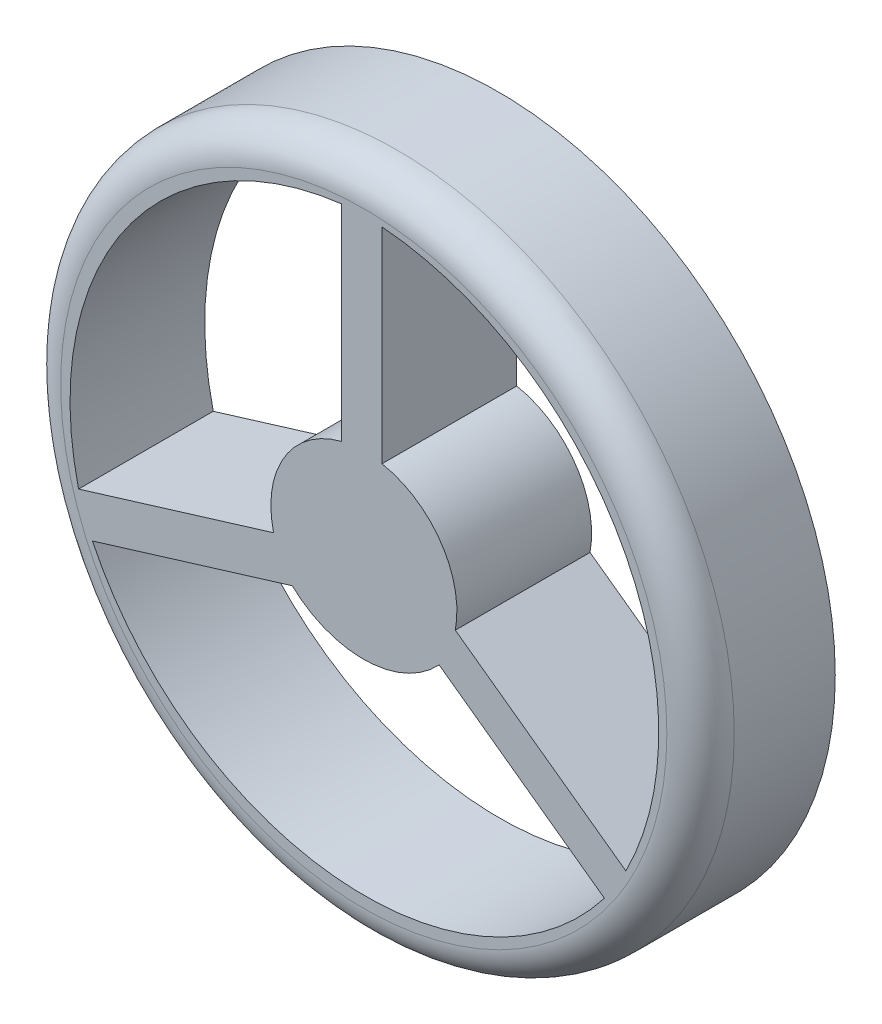
ISO-10303-21;
HEADER;
FILE_DESCRIPTION(('STEP AP214'),'2;1');
FILE_NAME('part.step','',(''),(''),'','','');
FILE_SCHEMA(('AUTOMOTIVE_DESIGN { 1 0 10303 214 1 1 1 1 }'));
ENDSEC;
DATA;
#1=APPLICATION_CONTEXT('core data for automotive mechanical design processes');
#2=APPLICATION_PROTOCOL_DEFINITION('international standard','automotive_design',2000,#1);
#3=PRODUCT_CONTEXT('',#1,'mechanical');
#4=PRODUCT('Part','Part','',(#3));
#5=PRODUCT_RELATED_PRODUCT_CATEGORY('part','',(#4));
#6=PRODUCT_DEFINITION_FORMATION('','',#4);
#7=PRODUCT_DEFINITION_CONTEXT('part definition',#1,'design');
#8=PRODUCT_DEFINITION('design','',#6,#7);
#9=PRODUCT_DEFINITION_SHAPE('','',#8);
#10=(LENGTH_UNIT() NAMED_UNIT(*) SI_UNIT(.MILLI.,.METRE.));
#11=(NAMED_UNIT(*) PLANE_ANGLE_UNIT() SI_UNIT($,.RADIAN.));
#12=(NAMED_UNIT(*) SI_UNIT($,.STERADIAN.) SOLID_ANGLE_UNIT());
#13=UNCERTAINTY_MEASURE_WITH_UNIT(LENGTH_MEASURE(1.E-05),#10,'distance_accuracy_value','');
#14=(GEOMETRIC_REPRESENTATION_CONTEXT(3) GLOBAL_UNCERTAINTY_ASSIGNED_CONTEXT((#13)) GLOBAL_UNIT_ASSIGNED_CONTEXT((#10,
#11,#12)) REPRESENTATION_CONTEXT('',''));
#15=CARTESIAN_POINT('',(0.,0.,0.));
#16=DIRECTION('',(0.,0.,1.));
#17=DIRECTION('',(1.,0.,0.));
#18=AXIS2_PLACEMENT_3D('',#15,#16,#17);
#19=CARTESIAN_POINT('',(0.,0.,1.016));
#20=DIRECTION('',(0.,0.,-1.));
#21=DIRECTION('',(-1.,0.,0.));
#22=AXIS2_PLACEMENT_3D('',#19,#20,#21);
#23=CYLINDRICAL_SURFACE('',#22,2.54);
#24=CARTESIAN_POINT('',(0.,0.,0.762));
#25=DIRECTION('',(0.,0.,1.));
#26=DIRECTION('',(1.,0.,0.));
#27=AXIS2_PLACEMENT_3D('',#24,#25,#26);
#28=CIRCLE('',#27,2.54);
#29=CARTESIAN_POINT('',(2.54,0.,0.762));
#30=VERTEX_POINT('',#29);
#31=EDGE_CURVE('E231',#30,#30,#28,.F.);
#32=ORIENTED_EDGE('',*,*,#31,.T.);
#33=EDGE_LOOP('',(#32));
#34=FACE_BOUND('',#33,.T.);
#35=CARTESIAN_POINT('',(0.,0.,0.));
#36=DIRECTION('',(0.,0.,1.));
#37=DIRECTION('',(1.,0.,0.));
#38=AXIS2_PLACEMENT_3D('',#35,#36,#37);
#39=CIRCLE('',#38,2.54);
#40=CARTESIAN_POINT('',(2.54,0.,0.));
#41=VERTEX_POINT('',#40);
#42=EDGE_CURVE('E214',#41,#41,#39,.T.);
#43=ORIENTED_EDGE('',*,*,#42,.T.);
#44=EDGE_LOOP('',(#43));
#45=FACE_BOUND('',#44,.T.);
#46=ADVANCED_FACE('F39',(#34,#45),#23,.T.);
#47=CARTESIAN_POINT('',(0.,0.,1.016));
#48=DIRECTION('',(0.,0.,1.));
#49=DIRECTION('',(1.,0.,0.));
#50=AXIS2_PLACEMENT_3D('',#47,#48,#49);
#51=PLANE('',#50);
#52=CARTESIAN_POINT('',(0.00855892402416253,0.0820124155876424,1.016));
#53=DIRECTION('',(0.,0.,1.));
#54=DIRECTION('',(-1.,0.,0.));
#55=AXIS2_PLACEMENT_3D('',#52,#53,#54);
#56=CIRCLE('',#55,2.28130644534514);
#57=CARTESIAN_POINT('',(-2.04654659285872,-0.908391750422774,1.016));
#58=VERTEX_POINT('',#57);
#59=CARTESIAN_POINT('',(1.81488867366252,-1.31137623555915,1.016));
#60=VERTEX_POINT('',#59);
#61=EDGE_CURVE('E55',#58,#60,#56,.T.);
#62=ORIENTED_EDGE('',*,*,#61,.F.);
#63=DIRECTION('',(-0.956254357187544,-0.292536500901745,0.));
#64=VECTOR('',#63,1.);
#65=CARTESIAN_POINT('',(-2.04654659285872,-0.908391750422774,1.016));
#66=LINE('',#65,#64);
#67=CARTESIAN_POINT('',(-0.539954252526794,-0.447496332573572,1.016));
#68=VERTEX_POINT('',#67);
#69=EDGE_CURVE('E179',#68,#58,#66,.T.);
#70=ORIENTED_EDGE('',*,*,#69,.F.);
#71=CARTESIAN_POINT('',(-0.00414957388450327,0.125079431993373,1.016));
#72=DIRECTION('',(0.,0.,-1.));
#73=DIRECTION('',(-1.,0.,0.));
#74=AXIS2_PLACEMENT_3D('',#71,#72,#73);
#75=CIRCLE('',#74,0.784174508527528);
#76=CARTESIAN_POINT('',(0.568426190682441,-0.410725246648918,1.016));
#77=VERTEX_POINT('',#76);
#78=EDGE_CURVE('E175',#77,#68,#75,.T.);
#79=ORIENTED_EDGE('',*,*,#78,.F.);
#80=DIRECTION('',(-0.810547078950531,0.585673486513401,0.));
#81=VECTOR('',#80,1.);
#82=CARTESIAN_POINT('',(1.81488867366252,-1.31137623555915,1.016));
#83=LINE('',#82,#81);
#84=EDGE_CURVE('E171',#60,#77,#83,.T.);
#85=ORIENTED_EDGE('',*,*,#84,.F.);
#86=EDGE_LOOP('',(#62,#70,#79,#85));
#87=FACE_BOUND('',#86,.T.);
#88=CARTESIAN_POINT('',(0.0086497220216127,0.00590180735438506,1.016));
#89=DIRECTION('',(0.,0.,-1.));
#90=DIRECTION('',(-1.,0.,0.));
#91=AXIS2_PLACEMENT_3D('',#88,#89,#90);
#92=CIRCLE('',#91,0.693843628539745);
#93=CARTESIAN_POINT('',(0.137399790738301,0.687695324975848,1.016));
#94=VERTEX_POINT('',#93);
#95=CARTESIAN_POINT('',(0.690443239643075,-0.122848261362304,1.016));
#96=VERTEX_POINT('',#95);
#97=EDGE_CURVE('E63',#94,#96,#92,.T.);
#98=ORIENTED_EDGE('',*,*,#97,.F.);
#99=DIRECTION('',(0.,-1.,0.));
#100=VECTOR('',#99,1.);
#101=CARTESIAN_POINT('',(0.137399790738301,0.687695324975848,1.016));
#102=LINE('',#101,#100);
#103=CARTESIAN_POINT('',(0.137399790738301,2.23487132213084,1.016));
#104=VERTEX_POINT('',#103);
#105=EDGE_CURVE('E155',#104,#94,#102,.T.);
#106=ORIENTED_EDGE('',*,*,#105,.F.);
#107=CARTESIAN_POINT('',(-0.0386478753602606,-0.0216239520621555,1.016));
#108=DIRECTION('',(0.,0.,1.));
#109=DIRECTION('',(-1.,0.,0.));
#110=AXIS2_PLACEMENT_3D('',#107,#108,#109);
#111=CIRCLE('',#110,2.26335231530447);
#112=CARTESIAN_POINT('',(1.97650795289077,-1.05211446199419,1.016));
#113=VERTEX_POINT('',#112);
#114=EDGE_CURVE('E136',#113,#104,#111,.T.);
#115=ORIENTED_EDGE('',*,*,#114,.F.);
#116=DIRECTION('',(0.81054707895053,-0.585673486513401,0.));
#117=VECTOR('',#116,1.);
#118=CARTESIAN_POINT('',(0.690443239643075,-0.122848261362304,1.016));
#119=LINE('',#118,#117);
#120=EDGE_CURVE('E147',#96,#113,#119,.T.);
#121=ORIENTED_EDGE('',*,*,#120,.F.);
#122=EDGE_LOOP('',(#98,#106,#115,#121));
#123=FACE_BOUND('',#122,.T.);
#124=CARTESIAN_POINT('',(0.111743508423927,-0.0776550778624359,1.016));
#125=DIRECTION('',(0.,0.,1.));
#126=DIRECTION('',(-1.,0.,0.));
#127=AXIS2_PLACEMENT_3D('',#124,#125,#126);
#128=CIRCLE('',#127,2.32728115225658);
#129=CARTESIAN_POINT('',(-0.167400209261699,2.23282460101929,1.016));
#130=VERTEX_POINT('',#129);
#131=CARTESIAN_POINT('',(-2.15107218203046,-0.621624482040826,1.016));
#132=VERTEX_POINT('',#131);
#133=EDGE_CURVE('E187',#130,#132,#128,.T.);
#134=ORIENTED_EDGE('',*,*,#133,.F.);
#135=DIRECTION('',(0.,1.,0.));
#136=VECTOR('',#135,1.);
#137=CARTESIAN_POINT('',(-0.167400209261699,0.681014487678276,1.016));
#138=LINE('',#137,#136);
#139=CARTESIAN_POINT('',(-0.167400209261699,0.681014487678276,1.016));
#140=VERTEX_POINT('',#139);
#141=EDGE_CURVE('E206',#140,#130,#138,.T.);
#142=ORIENTED_EDGE('',*,*,#141,.F.);
#143=CARTESIAN_POINT('',(0.002614627911072,-0.00157187653364869,1.016));
#144=DIRECTION('',(0.,0.,-1.));
#145=DIRECTION('',(-1.,0.,0.));
#146=AXIS2_PLACEMENT_3D('',#143,#144,#145);
#147=CIRCLE('',#146,0.703440963739629);
#148=CARTESIAN_POINT('',(-0.679971736300853,-0.171586713706418,1.016));
#149=VERTEX_POINT('',#148);
#150=EDGE_CURVE('E202',#149,#140,#147,.T.);
#151=ORIENTED_EDGE('',*,*,#150,.F.);
#152=DIRECTION('',(0.956254357187544,0.292536500901745,0.));
#153=VECTOR('',#152,1.);
#154=CARTESIAN_POINT('',(-2.15107218203046,-0.621624482040826,1.016));
#155=LINE('',#154,#153);
#156=EDGE_CURVE('E198',#132,#149,#155,.T.);
#157=ORIENTED_EDGE('',*,*,#156,.F.);
#158=EDGE_LOOP('',(#134,#142,#151,#157));
#159=FACE_BOUND('',#158,.T.);
#160=CARTESIAN_POINT('',(0.,0.,1.016));
#161=DIRECTION('',(0.,0.,1.));
#162=DIRECTION('',(1.,0.,0.));
#163=AXIS2_PLACEMENT_3D('',#160,#161,#162);
#164=CIRCLE('',#163,2.286);
#165=CARTESIAN_POINT('',(2.286,0.,1.016));
#166=VERTEX_POINT('',#165);
#167=EDGE_CURVE('E227',#166,#166,#164,.T.);
#168=ORIENTED_EDGE('',*,*,#167,.T.);
#169=EDGE_LOOP('',(#168));
#170=FACE_BOUND('',#169,.T.);
#171=ADVANCED_FACE('F152',(#87,#123,#159,#170),#51,.T.);
#172=CARTESIAN_POINT('',(0.,0.,0.));
#173=DIRECTION('',(0.,0.,1.));
#174=DIRECTION('',(1.,0.,0.));
#175=AXIS2_PLACEMENT_3D('',#172,#173,#174);
#176=PLANE('',#175);
#177=DIRECTION('',(-0.956254357187544,-0.292536500901745,0.));
#178=VECTOR('',#177,1.);
#179=CARTESIAN_POINT('',(0.0789743210531376,-0.258154241881617,0.));
#180=LINE('',#179,#178);
#181=CARTESIAN_POINT('',(-0.539954252526794,-0.447496332573572,0.));
#182=VERTEX_POINT('',#181);
#183=CARTESIAN_POINT('',(-2.04654659285872,-0.908391750422774,0.));
#184=VERTEX_POINT('',#183);
#185=EDGE_CURVE('E48',#182,#184,#180,.T.);
#186=ORIENTED_EDGE('',*,*,#185,.T.);
#187=CARTESIAN_POINT('',(0.00855892402416253,0.0820124155876424,0.));
#188=DIRECTION('',(0.,0.,1.));
#189=DIRECTION('',(1.,0.,0.));
#190=AXIS2_PLACEMENT_3D('',#187,#188,#189);
#191=CIRCLE('',#190,2.28130644534514);
#192=CARTESIAN_POINT('',(1.81488867366252,-1.31137623555915,0.));
#193=VERTEX_POINT('',#192);
#194=EDGE_CURVE('E11',#184,#193,#191,.T.);
#195=ORIENTED_EDGE('',*,*,#194,.T.);
#196=DIRECTION('',(-0.810547078950531,0.585673486513401,0.));
#197=VECTOR('',#196,1.);
#198=CARTESIAN_POINT('',(0.,0.,0.));
#199=LINE('',#198,#197);
#200=CARTESIAN_POINT('',(0.568426190682441,-0.410725246648918,0.));
#201=VERTEX_POINT('',#200);
#202=EDGE_CURVE('E264',#193,#201,#199,.T.);
#203=ORIENTED_EDGE('',*,*,#202,.T.);
#204=CARTESIAN_POINT('',(-0.00414957388450327,0.125079431993373,0.));
#205=DIRECTION('',(0.,0.,1.));
#206=DIRECTION('',(1.,0.,0.));
#207=AXIS2_PLACEMENT_3D('',#204,#205,#206);
#208=CIRCLE('',#207,0.784174508527528);
#209=EDGE_CURVE('E268',#201,#182,#208,.F.);
#210=ORIENTED_EDGE('',*,*,#209,.T.);
#211=EDGE_LOOP('',(#186,#195,#203,#210));
#212=FACE_BOUND('',#211,.T.);
#213=DIRECTION('',(0.,-1.,0.));
#214=VECTOR('',#213,1.);
#215=CARTESIAN_POINT('',(0.137399790738301,0.,0.));
#216=LINE('',#215,#214);
#217=CARTESIAN_POINT('',(0.137399790738301,2.23487132213084,0.));
#218=VERTEX_POINT('',#217);
#219=CARTESIAN_POINT('',(0.137399790738301,0.687695324975848,0.));
#220=VERTEX_POINT('',#219);
#221=EDGE_CURVE('E256',#218,#220,#216,.T.);
#222=ORIENTED_EDGE('',*,*,#221,.T.);
#223=CARTESIAN_POINT('',(0.0086497220216127,0.00590180735438506,0.));
#224=DIRECTION('',(0.,0.,1.));
#225=DIRECTION('',(1.,0.,0.));
#226=AXIS2_PLACEMENT_3D('',#223,#224,#225);
#227=CIRCLE('',#226,0.693843628539745);
#228=CARTESIAN_POINT('',(0.690443239643075,-0.122848261362304,0.));
#229=VERTEX_POINT('',#228);
#230=EDGE_CURVE('E260',#220,#229,#227,.F.);
#231=ORIENTED_EDGE('',*,*,#230,.T.);
#232=DIRECTION('',(0.810547078950531,-0.585673486513401,0.));
#233=VECTOR('',#232,1.);
#234=CARTESIAN_POINT('',(0.178513278689285,0.247054749664122,0.));
#235=LINE('',#234,#233);
#236=CARTESIAN_POINT('',(1.97650795289077,-1.05211446199419,0.));
#237=VERTEX_POINT('',#236);
#238=EDGE_CURVE('E251',#229,#237,#235,.T.);
#239=ORIENTED_EDGE('',*,*,#238,.T.);
#240=CARTESIAN_POINT('',(-0.0386478753602606,-0.0216239520621555,0.));
#241=DIRECTION('',(0.,0.,1.));
#242=DIRECTION('',(1.,0.,0.));
#243=AXIS2_PLACEMENT_3D('',#240,#241,#242);
#244=CIRCLE('',#243,2.26335231530447);
#245=EDGE_CURVE('E139',#237,#218,#244,.T.);
#246=ORIENTED_EDGE('',*,*,#245,.T.);
#247=EDGE_LOOP('',(#222,#231,#239,#246));
#248=FACE_BOUND('',#247,.T.);
#249=DIRECTION('',(0.,1.,0.));
#250=VECTOR('',#249,1.);
#251=CARTESIAN_POINT('',(-0.167400209261699,0.,0.));
#252=LINE('',#251,#250);
#253=CARTESIAN_POINT('',(-0.167400209261699,0.681014487678276,0.));
#254=VERTEX_POINT('',#253);
#255=CARTESIAN_POINT('',(-0.167400209261699,2.23282460101929,0.));
#256=VERTEX_POINT('',#255);
#257=EDGE_CURVE('E243',#254,#256,#252,.T.);
#258=ORIENTED_EDGE('',*,*,#257,.T.);
#259=CARTESIAN_POINT('',(0.111743508423927,-0.0776550778624359,0.));
#260=DIRECTION('',(0.,0.,1.));
#261=DIRECTION('',(1.,0.,0.));
#262=AXIS2_PLACEMENT_3D('',#259,#260,#261);
#263=CIRCLE('',#262,2.32728115225658);
#264=CARTESIAN_POINT('',(-2.15107218203046,-0.621624482040826,0.));
#265=VERTEX_POINT('',#264);
#266=EDGE_CURVE('E247',#256,#265,#263,.T.);
#267=ORIENTED_EDGE('',*,*,#266,.T.);
#268=DIRECTION('',(0.956254357187544,0.292536500901745,0.));
#269=VECTOR('',#268,1.);
#270=CARTESIAN_POINT('',(-0.0101908044217144,0.0333120861891472,0.));
#271=LINE('',#270,#269);
#272=CARTESIAN_POINT('',(-0.679971736300853,-0.171586713706418,0.));
#273=VERTEX_POINT('',#272);
#274=EDGE_CURVE('E235',#265,#273,#271,.T.);
#275=ORIENTED_EDGE('',*,*,#274,.T.);
#276=CARTESIAN_POINT('',(0.002614627911072,-0.00157187653364869,0.));
#277=DIRECTION('',(0.,0.,1.));
#278=DIRECTION('',(1.,0.,0.));
#279=AXIS2_PLACEMENT_3D('',#276,#277,#278);
#280=CIRCLE('',#279,0.703440963739629);
#281=EDGE_CURVE('E239',#273,#254,#280,.F.);
#282=ORIENTED_EDGE('',*,*,#281,.T.);
#283=EDGE_LOOP('',(#258,#267,#275,#282));
#284=FACE_BOUND('',#283,.T.);
#285=ORIENTED_EDGE('',*,*,#42,.F.);
#286=EDGE_LOOP('',(#285));
#287=FACE_BOUND('',#286,.T.);
#288=ADVANCED_FACE('F274',(#212,#248,#284,#287),#176,.F.);
#289=CARTESIAN_POINT('',(0.,0.,0.762));
#290=DIRECTION('',(0.,0.,1.));
#291=DIRECTION('',(1.,0.,0.));
#292=AXIS2_PLACEMENT_3D('',#289,#290,#291);
#293=TOROIDAL_SURFACE('',#292,2.286,0.254);
#294=ORIENTED_EDGE('',*,*,#31,.F.);
#295=EDGE_LOOP('',(#294));
#296=FACE_BOUND('',#295,.T.);
#297=ORIENTED_EDGE('',*,*,#167,.F.);
#298=EDGE_LOOP('',(#297));
#299=FACE_BOUND('',#298,.T.);
#300=ADVANCED_FACE('F41',(#296,#299),#293,.T.);
#301=CARTESIAN_POINT('',(0.111743508423927,-0.0776550778624359,-10.16));
#302=DIRECTION('',(0.,0.,1.));
#303=DIRECTION('',(1.,0.,0.));
#304=AXIS2_PLACEMENT_3D('',#301,#302,#303);
#305=CYLINDRICAL_SURFACE('',#304,2.32728115225658);
#306=DIRECTION('',(0.,0.,1.));
#307=VECTOR('',#306,1.);
#308=CARTESIAN_POINT('',(-0.167400209261699,2.23282460101929,-10.16));
#309=LINE('',#308,#307);
#310=EDGE_CURVE('E211',#256,#130,#309,.T.);
#311=ORIENTED_EDGE('',*,*,#310,.T.);
#312=ORIENTED_EDGE('',*,*,#133,.T.);
#313=DIRECTION('',(0.,0.,1.));
#314=VECTOR('',#313,1.);
#315=CARTESIAN_POINT('',(-2.15107218203046,-0.621624482040826,-10.16));
#316=LINE('',#315,#314);
#317=EDGE_CURVE('E210',#265,#132,#316,.T.);
#318=ORIENTED_EDGE('',*,*,#317,.F.);
#319=ORIENTED_EDGE('',*,*,#266,.F.);
#320=EDGE_LOOP('',(#311,#312,#318,#319));
#321=FACE_BOUND('',#320,.T.);
#322=ADVANCED_FACE('F310',(#321),#305,.F.);
#323=CARTESIAN_POINT('',(-0.167400209261699,0.681014487678276,-10.16));
#324=DIRECTION('',(1.,0.,0.));
#325=DIRECTION('',(0.,1.,0.));
#326=AXIS2_PLACEMENT_3D('',#323,#324,#325);
#327=PLANE('',#326);
#328=DIRECTION('',(0.,0.,1.));
#329=VECTOR('',#328,1.);
#330=CARTESIAN_POINT('',(-0.167400209261699,0.681014487678276,-10.16));
#331=LINE('',#330,#329);
#332=EDGE_CURVE('E215',#254,#140,#331,.T.);
#333=ORIENTED_EDGE('',*,*,#332,.T.);
#334=ORIENTED_EDGE('',*,*,#141,.T.);
#335=ORIENTED_EDGE('',*,*,#310,.F.);
#336=ORIENTED_EDGE('',*,*,#257,.F.);
#337=EDGE_LOOP('',(#333,#334,#335,#336));
#338=FACE_BOUND('',#337,.T.);
#339=ADVANCED_FACE('F313',(#338),#327,.F.);
#340=CARTESIAN_POINT('',(0.002614627911072,-0.00157187653364869,-10.16));
#341=DIRECTION('',(0.,0.,1.));
#342=DIRECTION('',(1.,0.,0.));
#343=AXIS2_PLACEMENT_3D('',#340,#341,#342);
#344=CYLINDRICAL_SURFACE('',#343,0.703440963739629);
#345=DIRECTION('',(0.,0.,1.));
#346=VECTOR('',#345,1.);
#347=CARTESIAN_POINT('',(-0.679971736300853,-0.171586713706418,-10.16));
#348=LINE('',#347,#346);
#349=EDGE_CURVE('E218',#273,#149,#348,.T.);
#350=ORIENTED_EDGE('',*,*,#349,.T.);
#351=ORIENTED_EDGE('',*,*,#150,.T.);
#352=ORIENTED_EDGE('',*,*,#332,.F.);
#353=ORIENTED_EDGE('',*,*,#281,.F.);
#354=EDGE_LOOP('',(#350,#351,#352,#353));
#355=FACE_BOUND('',#354,.T.);
#356=ADVANCED_FACE('F319',(#355),#344,.T.);
#357=CARTESIAN_POINT('',(-2.15107218203046,-0.621624482040826,-10.16));
#358=DIRECTION('',(0.292536500901745,-0.956254357187544,0.));
#359=DIRECTION('',(0.956254357187544,0.292536500901745,0.));
#360=AXIS2_PLACEMENT_3D('',#357,#358,#359);
#361=PLANE('',#360);
#362=ORIENTED_EDGE('',*,*,#317,.T.);
#363=ORIENTED_EDGE('',*,*,#156,.T.);
#364=ORIENTED_EDGE('',*,*,#349,.F.);
#365=ORIENTED_EDGE('',*,*,#274,.F.);
#366=EDGE_LOOP('',(#362,#363,#364,#365));
#367=FACE_BOUND('',#366,.T.);
#368=ADVANCED_FACE('F315',(#367),#361,.F.);
#369=CARTESIAN_POINT('',(0.0086497220216127,0.00590180735438506,-10.16));
#370=DIRECTION('',(0.,0.,1.));
#371=DIRECTION('',(1.,0.,0.));
#372=AXIS2_PLACEMENT_3D('',#369,#370,#371);
#373=CYLINDRICAL_SURFACE('',#372,0.693843628539745);
#374=DIRECTION('',(0.,0.,1.));
#375=VECTOR('',#374,1.);
#376=CARTESIAN_POINT('',(0.137399790738301,0.687695324975848,-10.16));
#377=LINE('',#376,#375);
#378=EDGE_CURVE('E162',#220,#94,#377,.T.);
#379=ORIENTED_EDGE('',*,*,#378,.T.);
#380=ORIENTED_EDGE('',*,*,#97,.T.);
#381=DIRECTION('',(0.,0.,1.));
#382=VECTOR('',#381,1.);
#383=CARTESIAN_POINT('',(0.690443239643075,-0.122848261362304,-10.16));
#384=LINE('',#383,#382);
#385=EDGE_CURVE('E144',#229,#96,#384,.T.);
#386=ORIENTED_EDGE('',*,*,#385,.F.);
#387=ORIENTED_EDGE('',*,*,#230,.F.);
#388=EDGE_LOOP('',(#379,#380,#386,#387));
#389=FACE_BOUND('',#388,.T.);
#390=ADVANCED_FACE('F318',(#389),#373,.T.);
#391=CARTESIAN_POINT('',(0.137399790738301,0.687695324975848,-10.16));
#392=DIRECTION('',(-1.,0.,0.));
#393=DIRECTION('',(0.,0.,1.));
#394=AXIS2_PLACEMENT_3D('',#391,#392,#393);
#395=PLANE('',#394);
#396=DIRECTION('',(0.,0.,1.));
#397=VECTOR('',#396,1.);
#398=CARTESIAN_POINT('',(0.137399790738301,2.23487132213084,-10.16));
#399=LINE('',#398,#397);
#400=EDGE_CURVE('E143',#218,#104,#399,.T.);
#401=ORIENTED_EDGE('',*,*,#400,.T.);
#402=ORIENTED_EDGE('',*,*,#105,.T.);
#403=ORIENTED_EDGE('',*,*,#378,.F.);
#404=ORIENTED_EDGE('',*,*,#221,.F.);
#405=EDGE_LOOP('',(#401,#402,#403,#404));
#406=FACE_BOUND('',#405,.T.);
#407=ADVANCED_FACE('F380',(#406),#395,.F.);
#408=CARTESIAN_POINT('',(-0.0386478753602606,-0.0216239520621555,-10.16));
#409=DIRECTION('',(0.,0.,1.));
#410=DIRECTION('',(1.,0.,0.));
#411=AXIS2_PLACEMENT_3D('',#408,#409,#410);
#412=CYLINDRICAL_SURFACE('',#411,2.26335231530447);
#413=DIRECTION('',(0.,0.,1.));
#414=VECTOR('',#413,1.);
#415=CARTESIAN_POINT('',(1.97650795289077,-1.05211446199419,-10.16));
#416=LINE('',#415,#414);
#417=EDGE_CURVE('E131',#237,#113,#416,.T.);
#418=ORIENTED_EDGE('',*,*,#417,.T.);
#419=ORIENTED_EDGE('',*,*,#114,.T.);
#420=ORIENTED_EDGE('',*,*,#400,.F.);
#421=ORIENTED_EDGE('',*,*,#245,.F.);
#422=EDGE_LOOP('',(#418,#419,#420,#421));
#423=FACE_BOUND('',#422,.T.);
#424=ADVANCED_FACE('F133',(#423),#412,.F.);
#425=CARTESIAN_POINT('',(0.690443239643075,-0.122848261362304,-10.16));
#426=DIRECTION('',(-0.585673486513401,-0.81054707895053,0.));
#427=DIRECTION('',(0.810547078950531,-0.585673486513401,0.));
#428=AXIS2_PLACEMENT_3D('',#425,#426,#427);
#429=PLANE('',#428);
#430=ORIENTED_EDGE('',*,*,#385,.T.);
#431=ORIENTED_EDGE('',*,*,#120,.T.);
#432=ORIENTED_EDGE('',*,*,#417,.F.);
#433=ORIENTED_EDGE('',*,*,#238,.F.);
#434=EDGE_LOOP('',(#430,#431,#432,#433));
#435=FACE_BOUND('',#434,.T.);
#436=ADVANCED_FACE('F148',(#435),#429,.F.);
#437=CARTESIAN_POINT('',(0.00855892402416253,0.0820124155876424,-10.16));
#438=DIRECTION('',(0.,0.,1.));
#439=DIRECTION('',(1.,0.,0.));
#440=AXIS2_PLACEMENT_3D('',#437,#438,#439);
#441=CYLINDRICAL_SURFACE('',#440,2.28130644534514);
#442=DIRECTION('',(0.,0.,1.));
#443=VECTOR('',#442,1.);
#444=CARTESIAN_POINT('',(-2.04654659285872,-0.908391750422774,-10.16));
#445=LINE('',#444,#443);
#446=EDGE_CURVE('E184',#184,#58,#445,.T.);
#447=ORIENTED_EDGE('',*,*,#446,.T.);
#448=ORIENTED_EDGE('',*,*,#61,.T.);
#449=DIRECTION('',(0.,0.,1.));
#450=VECTOR('',#449,1.);
#451=CARTESIAN_POINT('',(1.81488867366252,-1.31137623555915,-10.16));
#452=LINE('',#451,#450);
#453=EDGE_CURVE('E183',#193,#60,#452,.T.);
#454=ORIENTED_EDGE('',*,*,#453,.F.);
#455=ORIENTED_EDGE('',*,*,#194,.F.);
#456=EDGE_LOOP('',(#447,#448,#454,#455));
#457=FACE_BOUND('',#456,.T.);
#458=ADVANCED_FACE('F289',(#457),#441,.F.);
#459=CARTESIAN_POINT('',(-2.04654659285872,-0.908391750422774,-10.16));
#460=DIRECTION('',(-0.292536500901745,0.956254357187544,0.));
#461=DIRECTION('',(-0.956254357187544,-0.292536500901745,0.));
#462=AXIS2_PLACEMENT_3D('',#459,#460,#461);
#463=PLANE('',#462);
#464=DIRECTION('',(0.,0.,1.));
#465=VECTOR('',#464,1.);
#466=CARTESIAN_POINT('',(-0.539954252526794,-0.447496332573572,-10.16));
#467=LINE('',#466,#465);
#468=EDGE_CURVE('E188',#182,#68,#467,.T.);
#469=ORIENTED_EDGE('',*,*,#468,.T.);
#470=ORIENTED_EDGE('',*,*,#69,.T.);
#471=ORIENTED_EDGE('',*,*,#446,.F.);
#472=ORIENTED_EDGE('',*,*,#185,.F.);
#473=EDGE_LOOP('',(#469,#470,#471,#472));
#474=FACE_BOUND('',#473,.T.);
#475=ADVANCED_FACE('F280',(#474),#463,.F.);
#476=CARTESIAN_POINT('',(-0.00414957388450327,0.125079431993373,-10.16));
#477=DIRECTION('',(0.,0.,1.));
#478=DIRECTION('',(1.,0.,0.));
#479=AXIS2_PLACEMENT_3D('',#476,#477,#478);
#480=CYLINDRICAL_SURFACE('',#479,0.784174508527528);
#481=DIRECTION('',(0.,0.,1.));
#482=VECTOR('',#481,1.);
#483=CARTESIAN_POINT('',(0.568426190682441,-0.410725246648918,-10.16));
#484=LINE('',#483,#482);
#485=EDGE_CURVE('E191',#201,#77,#484,.T.);
#486=ORIENTED_EDGE('',*,*,#485,.T.);
#487=ORIENTED_EDGE('',*,*,#78,.T.);
#488=ORIENTED_EDGE('',*,*,#468,.F.);
#489=ORIENTED_EDGE('',*,*,#209,.F.);
#490=EDGE_LOOP('',(#486,#487,#488,#489));
#491=FACE_BOUND('',#490,.T.);
#492=ADVANCED_FACE('F282',(#491),#480,.T.);
#493=CARTESIAN_POINT('',(1.81488867366252,-1.31137623555915,-10.16));
#494=DIRECTION('',(0.585673486513401,0.810547078950531,0.));
#495=DIRECTION('',(-0.810547078950531,0.585673486513401,0.));
#496=AXIS2_PLACEMENT_3D('',#493,#494,#495);
#497=PLANE('',#496);
#498=ORIENTED_EDGE('',*,*,#453,.T.);
#499=ORIENTED_EDGE('',*,*,#84,.T.);
#500=ORIENTED_EDGE('',*,*,#485,.F.);
#501=ORIENTED_EDGE('',*,*,#202,.F.);
#502=EDGE_LOOP('',(#498,#499,#500,#501));
#503=FACE_BOUND('',#502,.T.);
#504=ADVANCED_FACE('F288',(#503),#497,.F.);
#505=CLOSED_SHELL('',(#46,#171,#288,#300,#322,#339,#356,#368,#390,#407,#424,#436,#458,#475,#492,#504));
#506=MANIFOLD_SOLID_BREP('B2',#505);
#507=ADVANCED_BREP_SHAPE_REPRESENTATION('',(#18,#506),#14);
#508=SHAPE_DEFINITION_REPRESENTATION(#9,#507);
ENDSEC;
END-ISO-10303-21;
